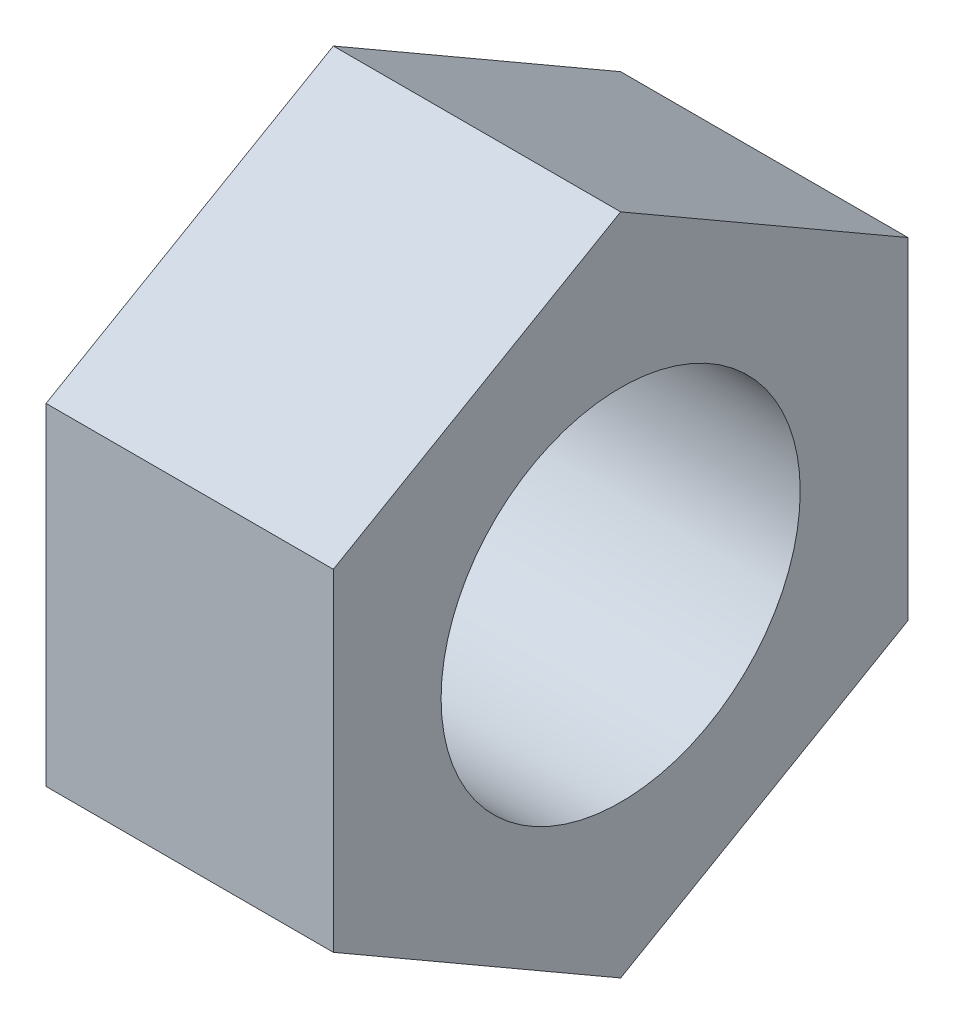
ISO-10303-21;
HEADER;
FILE_DESCRIPTION(('STEP AP214'),'2;1');
FILE_NAME('part.step','',(''),(''),'','','');
FILE_SCHEMA(('AUTOMOTIVE_DESIGN { 1 0 10303 214 1 1 1 1 }'));
ENDSEC;
DATA;
#1=APPLICATION_CONTEXT('core data for automotive mechanical design processes');
#2=APPLICATION_PROTOCOL_DEFINITION('international standard','automotive_design',2000,#1);
#3=PRODUCT_CONTEXT('',#1,'mechanical');
#4=PRODUCT('Part','Part','',(#3));
#5=PRODUCT_RELATED_PRODUCT_CATEGORY('part','',(#4));
#6=PRODUCT_DEFINITION_FORMATION('','',#4);
#7=PRODUCT_DEFINITION_CONTEXT('part definition',#1,'design');
#8=PRODUCT_DEFINITION('design','',#6,#7);
#9=PRODUCT_DEFINITION_SHAPE('','',#8);
#10=(LENGTH_UNIT() NAMED_UNIT(*) SI_UNIT(.MILLI.,.METRE.));
#11=(NAMED_UNIT(*) PLANE_ANGLE_UNIT() SI_UNIT($,.RADIAN.));
#12=(NAMED_UNIT(*) SI_UNIT($,.STERADIAN.) SOLID_ANGLE_UNIT());
#13=UNCERTAINTY_MEASURE_WITH_UNIT(LENGTH_MEASURE(1.E-05),#10,'distance_accuracy_value','');
#14=(GEOMETRIC_REPRESENTATION_CONTEXT(3) GLOBAL_UNCERTAINTY_ASSIGNED_CONTEXT((#13)) GLOBAL_UNIT_ASSIGNED_CONTEXT((#10,
#11,#12)) REPRESENTATION_CONTEXT('',''));
#15=CARTESIAN_POINT('',(0.,0.,0.));
#16=DIRECTION('',(0.,0.,1.));
#17=DIRECTION('',(1.,0.,0.));
#18=AXIS2_PLACEMENT_3D('',#15,#16,#17);
#19=CARTESIAN_POINT('',(6.35,0.,0.));
#20=DIRECTION('',(1.,0.,0.));
#21=DIRECTION('',(0.,0.,-1.));
#22=AXIS2_PLACEMENT_3D('',#19,#20,#21);
#23=PLANE('',#22);
#24=DIRECTION('',(0.,0.499999999999992,0.866025403784443));
#25=VECTOR('',#24,1.);
#26=CARTESIAN_POINT('',(6.35,3.66617420935419,-6.34999999999997));
#27=LINE('',#26,#25);
#28=CARTESIAN_POINT('',(6.35,3.66617420935419,-6.34999999999997));
#29=VERTEX_POINT('',#28);
#30=CARTESIAN_POINT('',(6.35,7.33234841870825,0.));
#31=VERTEX_POINT('',#30);
#32=EDGE_CURVE('E129',#29,#31,#27,.T.);
#33=ORIENTED_EDGE('',*,*,#32,.T.);
#34=DIRECTION('',(0.,-0.500000000000008,0.866025403784434));
#35=VECTOR('',#34,1.);
#36=CARTESIAN_POINT('',(6.35,7.33234841870825,0.));
#37=LINE('',#36,#35);
#38=CARTESIAN_POINT('',(6.35,3.66617420935407,6.35000000000004));
#39=VERTEX_POINT('',#38);
#40=EDGE_CURVE('E87',#31,#39,#37,.T.);
#41=ORIENTED_EDGE('',*,*,#40,.T.);
#42=DIRECTION('',(0.,-1.,0.));
#43=VECTOR('',#42,1.);
#44=CARTESIAN_POINT('',(6.35,3.66617420935407,6.35000000000004));
#45=LINE('',#44,#43);
#46=CARTESIAN_POINT('',(6.35,-3.66617420935418,6.34999999999997));
#47=VERTEX_POINT('',#46);
#48=EDGE_CURVE('E100',#39,#47,#45,.T.);
#49=ORIENTED_EDGE('',*,*,#48,.T.);
#50=DIRECTION('',(0.,-0.499999999999992,-0.866025403784443));
#51=VECTOR('',#50,1.);
#52=CARTESIAN_POINT('',(6.35,-3.66617420935418,6.34999999999997));
#53=LINE('',#52,#51);
#54=CARTESIAN_POINT('',(6.35,-7.33234841870825,0.));
#55=VERTEX_POINT('',#54);
#56=EDGE_CURVE('E94',#47,#55,#53,.T.);
#57=ORIENTED_EDGE('',*,*,#56,.T.);
#58=DIRECTION('',(0.,0.500000000000008,-0.866025403784434));
#59=VECTOR('',#58,1.);
#60=CARTESIAN_POINT('',(6.35,-7.33234841870825,0.));
#61=LINE('',#60,#59);
#62=CARTESIAN_POINT('',(6.35,-3.66617420935407,-6.35000000000004));
#63=VERTEX_POINT('',#62);
#64=EDGE_CURVE('E98',#55,#63,#61,.T.);
#65=ORIENTED_EDGE('',*,*,#64,.T.);
#66=DIRECTION('',(0.,1.,0.));
#67=VECTOR('',#66,1.);
#68=CARTESIAN_POINT('',(6.35,-3.66617420935407,-6.35000000000004));
#69=LINE('',#68,#67);
#70=EDGE_CURVE('E50',#63,#29,#69,.T.);
#71=ORIENTED_EDGE('',*,*,#70,.T.);
#72=EDGE_LOOP('',(#33,#41,#49,#57,#65,#71));
#73=FACE_BOUND('',#72,.T.);
#74=CARTESIAN_POINT('',(6.35,0.,0.));
#75=DIRECTION('',(1.,0.,0.));
#76=DIRECTION('',(0.,0.,-1.));
#77=AXIS2_PLACEMENT_3D('',#74,#75,#76);
#78=CIRCLE('',#77,3.96875);
#79=CARTESIAN_POINT('',(6.35,0.,-3.96875));
#80=VERTEX_POINT('',#79);
#81=EDGE_CURVE('E122',#80,#80,#78,.T.);
#82=ORIENTED_EDGE('',*,*,#81,.F.);
#83=EDGE_LOOP('',(#82));
#84=FACE_BOUND('',#83,.T.);
#85=ADVANCED_FACE('F33',(#73,#84),#23,.T.);
#86=CARTESIAN_POINT('',(0.,0.,0.));
#87=DIRECTION('',(1.,0.,0.));
#88=DIRECTION('',(0.,0.,-1.));
#89=AXIS2_PLACEMENT_3D('',#86,#87,#88);
#90=PLANE('',#89);
#91=DIRECTION('',(0.,0.499999999999992,0.866025403784443));
#92=VECTOR('',#91,1.);
#93=CARTESIAN_POINT('',(0.,3.66617420935419,-6.34999999999997));
#94=LINE('',#93,#92);
#95=CARTESIAN_POINT('',(0.,3.66617420935419,-6.34999999999997));
#96=VERTEX_POINT('',#95);
#97=CARTESIAN_POINT('',(0.,7.33234841870825,0.));
#98=VERTEX_POINT('',#97);
#99=EDGE_CURVE('E118',#96,#98,#94,.T.);
#100=ORIENTED_EDGE('',*,*,#99,.F.);
#101=DIRECTION('',(0.,1.,0.));
#102=VECTOR('',#101,1.);
#103=CARTESIAN_POINT('',(0.,-3.66617420935407,-6.35000000000004));
#104=LINE('',#103,#102);
#105=CARTESIAN_POINT('',(0.,-3.66617420935407,-6.35000000000004));
#106=VERTEX_POINT('',#105);
#107=EDGE_CURVE('E79',#106,#96,#104,.T.);
#108=ORIENTED_EDGE('',*,*,#107,.F.);
#109=DIRECTION('',(0.,0.500000000000008,-0.866025403784434));
#110=VECTOR('',#109,1.);
#111=CARTESIAN_POINT('',(0.,-7.33234841870825,0.));
#112=LINE('',#111,#110);
#113=CARTESIAN_POINT('',(0.,-7.33234841870825,0.));
#114=VERTEX_POINT('',#113);
#115=EDGE_CURVE('E73',#114,#106,#112,.T.);
#116=ORIENTED_EDGE('',*,*,#115,.F.);
#117=DIRECTION('',(0.,-0.499999999999992,-0.866025403784443));
#118=VECTOR('',#117,1.);
#119=CARTESIAN_POINT('',(0.,-3.66617420935418,6.34999999999997));
#120=LINE('',#119,#118);
#121=CARTESIAN_POINT('',(0.,-3.66617420935418,6.34999999999997));
#122=VERTEX_POINT('',#121);
#123=EDGE_CURVE('E108',#122,#114,#120,.T.);
#124=ORIENTED_EDGE('',*,*,#123,.F.);
#125=DIRECTION('',(0.,-1.,0.));
#126=VECTOR('',#125,1.);
#127=CARTESIAN_POINT('',(0.,3.66617420935407,6.35000000000004));
#128=LINE('',#127,#126);
#129=CARTESIAN_POINT('',(0.,3.66617420935407,6.35000000000004));
#130=VERTEX_POINT('',#129);
#131=EDGE_CURVE('E124',#130,#122,#128,.T.);
#132=ORIENTED_EDGE('',*,*,#131,.F.);
#133=DIRECTION('',(0.,-0.500000000000008,0.866025403784434));
#134=VECTOR('',#133,1.);
#135=CARTESIAN_POINT('',(0.,7.33234841870825,0.));
#136=LINE('',#135,#134);
#137=EDGE_CURVE('E121',#98,#130,#136,.T.);
#138=ORIENTED_EDGE('',*,*,#137,.F.);
#139=EDGE_LOOP('',(#100,#108,#116,#124,#132,#138));
#140=FACE_BOUND('',#139,.T.);
#141=CARTESIAN_POINT('',(0.,0.,0.));
#142=DIRECTION('',(1.,0.,0.));
#143=DIRECTION('',(0.,0.,-1.));
#144=AXIS2_PLACEMENT_3D('',#141,#142,#143);
#145=CIRCLE('',#144,3.96875);
#146=CARTESIAN_POINT('',(0.,0.,-3.96875));
#147=VERTEX_POINT('',#146);
#148=EDGE_CURVE('E222',#147,#147,#145,.T.);
#149=ORIENTED_EDGE('',*,*,#148,.T.);
#150=EDGE_LOOP('',(#149));
#151=FACE_BOUND('',#150,.T.);
#152=ADVANCED_FACE('F138',(#140,#151),#90,.F.);
#153=CARTESIAN_POINT('',(6.35,3.66617420935419,-6.34999999999997));
#154=DIRECTION('',(0.,-0.866025403784443,0.499999999999992));
#155=DIRECTION('',(0.,-0.499999999999992,-0.866025403784443));
#156=AXIS2_PLACEMENT_3D('',#153,#154,#155);
#157=PLANE('',#156);
#158=ORIENTED_EDGE('',*,*,#99,.T.);
#159=DIRECTION('',(-1.,0.,0.));
#160=VECTOR('',#159,1.);
#161=CARTESIAN_POINT('',(6.35,7.33234841870825,0.));
#162=LINE('',#161,#160);
#163=EDGE_CURVE('E11',#31,#98,#162,.T.);
#164=ORIENTED_EDGE('',*,*,#163,.F.);
#165=ORIENTED_EDGE('',*,*,#32,.F.);
#166=DIRECTION('',(-1.,0.,0.));
#167=VECTOR('',#166,1.);
#168=CARTESIAN_POINT('',(6.35,3.66617420935419,-6.34999999999997));
#169=LINE('',#168,#167);
#170=EDGE_CURVE('E114',#29,#96,#169,.T.);
#171=ORIENTED_EDGE('',*,*,#170,.T.);
#172=EDGE_LOOP('',(#158,#164,#165,#171));
#173=FACE_BOUND('',#172,.T.);
#174=ADVANCED_FACE('F35',(#173),#157,.F.);
#175=CARTESIAN_POINT('',(6.35,7.33234841870825,0.));
#176=DIRECTION('',(0.,-0.866025403784434,-0.500000000000008));
#177=DIRECTION('',(0.,0.500000000000008,-0.866025403784434));
#178=AXIS2_PLACEMENT_3D('',#175,#176,#177);
#179=PLANE('',#178);
#180=ORIENTED_EDGE('',*,*,#137,.T.);
#181=DIRECTION('',(-1.,0.,0.));
#182=VECTOR('',#181,1.);
#183=CARTESIAN_POINT('',(6.35,3.66617420935407,6.35000000000004));
#184=LINE('',#183,#182);
#185=EDGE_CURVE('E42',#39,#130,#184,.T.);
#186=ORIENTED_EDGE('',*,*,#185,.F.);
#187=ORIENTED_EDGE('',*,*,#40,.F.);
#188=ORIENTED_EDGE('',*,*,#163,.T.);
#189=EDGE_LOOP('',(#180,#186,#187,#188));
#190=FACE_BOUND('',#189,.T.);
#191=ADVANCED_FACE('F163',(#190),#179,.F.);
#192=CARTESIAN_POINT('',(6.35,3.66617420935407,6.35000000000004));
#193=DIRECTION('',(0.,0.,-1.));
#194=DIRECTION('',(0.,1.,0.));
#195=AXIS2_PLACEMENT_3D('',#192,#193,#194);
#196=PLANE('',#195);
#197=ORIENTED_EDGE('',*,*,#131,.T.);
#198=DIRECTION('',(-1.,0.,0.));
#199=VECTOR('',#198,1.);
#200=CARTESIAN_POINT('',(6.35,-3.66617420935418,6.34999999999997));
#201=LINE('',#200,#199);
#202=EDGE_CURVE('E109',#47,#122,#201,.T.);
#203=ORIENTED_EDGE('',*,*,#202,.F.);
#204=ORIENTED_EDGE('',*,*,#48,.F.);
#205=ORIENTED_EDGE('',*,*,#185,.T.);
#206=EDGE_LOOP('',(#197,#203,#204,#205));
#207=FACE_BOUND('',#206,.T.);
#208=ADVANCED_FACE('F135',(#207),#196,.F.);
#209=CARTESIAN_POINT('',(6.35,-3.66617420935418,6.34999999999997));
#210=DIRECTION('',(0.,0.866025403784443,-0.499999999999992));
#211=DIRECTION('',(0.,0.499999999999992,0.866025403784443));
#212=AXIS2_PLACEMENT_3D('',#209,#210,#211);
#213=PLANE('',#212);
#214=ORIENTED_EDGE('',*,*,#123,.T.);
#215=DIRECTION('',(-1.,0.,0.));
#216=VECTOR('',#215,1.);
#217=CARTESIAN_POINT('',(6.35,-7.33234841870825,0.));
#218=LINE('',#217,#216);
#219=EDGE_CURVE('E105',#55,#114,#218,.T.);
#220=ORIENTED_EDGE('',*,*,#219,.F.);
#221=ORIENTED_EDGE('',*,*,#56,.F.);
#222=ORIENTED_EDGE('',*,*,#202,.T.);
#223=EDGE_LOOP('',(#214,#220,#221,#222));
#224=FACE_BOUND('',#223,.T.);
#225=ADVANCED_FACE('F106',(#224),#213,.F.);
#226=CARTESIAN_POINT('',(6.35,-7.33234841870825,0.));
#227=DIRECTION('',(0.,0.866025403784434,0.500000000000008));
#228=DIRECTION('',(0.,-0.500000000000008,0.866025403784434));
#229=AXIS2_PLACEMENT_3D('',#226,#227,#228);
#230=PLANE('',#229);
#231=ORIENTED_EDGE('',*,*,#115,.T.);
#232=DIRECTION('',(-1.,0.,0.));
#233=VECTOR('',#232,1.);
#234=CARTESIAN_POINT('',(6.35,-3.66617420935407,-6.35000000000004));
#235=LINE('',#234,#233);
#236=EDGE_CURVE('E110',#63,#106,#235,.T.);
#237=ORIENTED_EDGE('',*,*,#236,.F.);
#238=ORIENTED_EDGE('',*,*,#64,.F.);
#239=ORIENTED_EDGE('',*,*,#219,.T.);
#240=EDGE_LOOP('',(#231,#237,#238,#239));
#241=FACE_BOUND('',#240,.T.);
#242=ADVANCED_FACE('F112',(#241),#230,.F.);
#243=CARTESIAN_POINT('',(6.35,-3.66617420935407,-6.35000000000004));
#244=DIRECTION('',(0.,0.,1.));
#245=DIRECTION('',(0.,-1.,0.));
#246=AXIS2_PLACEMENT_3D('',#243,#244,#245);
#247=PLANE('',#246);
#248=ORIENTED_EDGE('',*,*,#107,.T.);
#249=ORIENTED_EDGE('',*,*,#170,.F.);
#250=ORIENTED_EDGE('',*,*,#70,.F.);
#251=ORIENTED_EDGE('',*,*,#236,.T.);
#252=EDGE_LOOP('',(#248,#249,#250,#251));
#253=FACE_BOUND('',#252,.T.);
#254=ADVANCED_FACE('F143',(#253),#247,.F.);
#255=CARTESIAN_POINT('',(6.35,0.,0.));
#256=DIRECTION('',(-1.,0.,0.));
#257=DIRECTION('',(0.,0.,1.));
#258=AXIS2_PLACEMENT_3D('',#255,#256,#257);
#259=CYLINDRICAL_SURFACE('',#258,3.96875);
#260=ORIENTED_EDGE('',*,*,#81,.T.);
#261=EDGE_LOOP('',(#260));
#262=FACE_BOUND('',#261,.T.);
#263=ORIENTED_EDGE('',*,*,#148,.F.);
#264=EDGE_LOOP('',(#263));
#265=FACE_BOUND('',#264,.T.);
#266=ADVANCED_FACE('F145',(#262,#265),#259,.F.);
#267=CLOSED_SHELL('',(#85,#152,#174,#191,#208,#225,#242,#254,#266));
#268=MANIFOLD_SOLID_BREP('B2',#267);
#269=ADVANCED_BREP_SHAPE_REPRESENTATION('',(#18,#268),#14);
#270=SHAPE_DEFINITION_REPRESENTATION(#9,#269);
ENDSEC;
END-ISO-10303-21;
